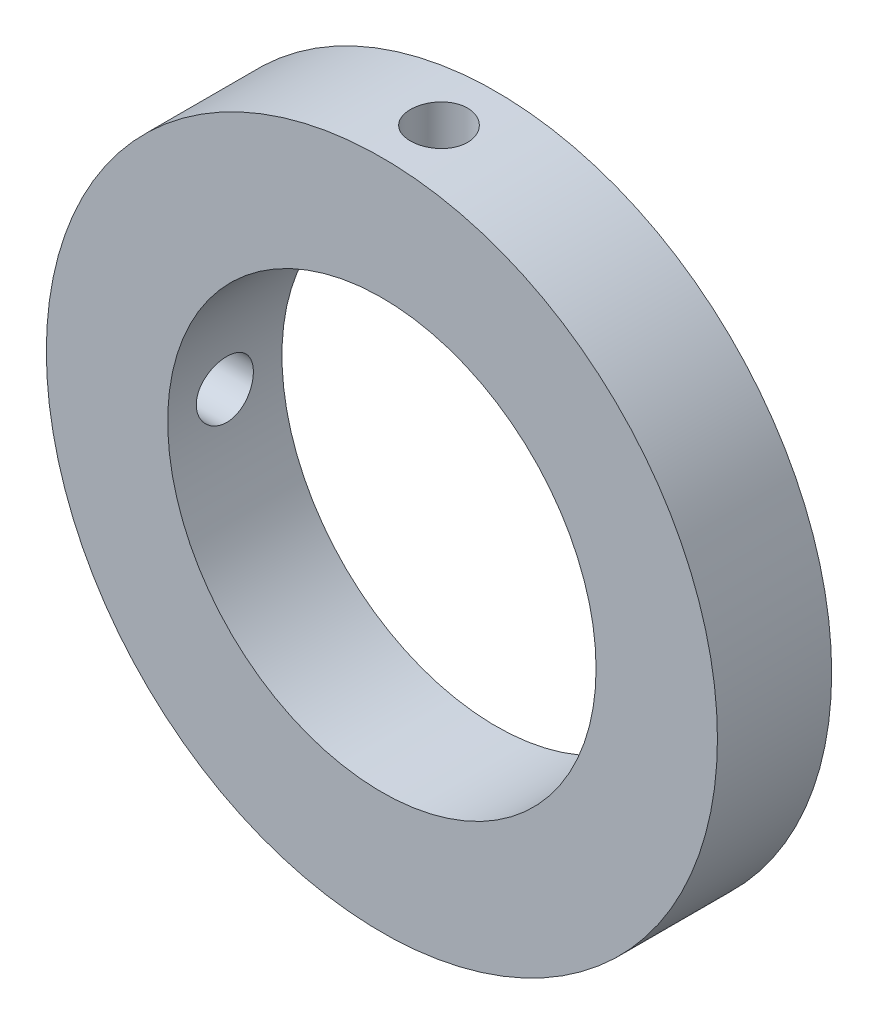
ISO-10303-21;
HEADER;
FILE_DESCRIPTION(('STEP AP214'),'2;1');
FILE_NAME('part.step','',(''),(''),'','','');
FILE_SCHEMA(('AUTOMOTIVE_DESIGN { 1 0 10303 214 1 1 1 1 }'));
ENDSEC;
DATA;
#1=APPLICATION_CONTEXT('core data for automotive mechanical design processes');
#2=APPLICATION_PROTOCOL_DEFINITION('international standard','automotive_design',2000,#1);
#3=PRODUCT_CONTEXT('',#1,'mechanical');
#4=PRODUCT('Part','Part','',(#3));
#5=PRODUCT_RELATED_PRODUCT_CATEGORY('part','',(#4));
#6=PRODUCT_DEFINITION_FORMATION('','',#4);
#7=PRODUCT_DEFINITION_CONTEXT('part definition',#1,'design');
#8=PRODUCT_DEFINITION('design','',#6,#7);
#9=PRODUCT_DEFINITION_SHAPE('','',#8);
#10=(LENGTH_UNIT() NAMED_UNIT(*) SI_UNIT(.MILLI.,.METRE.));
#11=(NAMED_UNIT(*) PLANE_ANGLE_UNIT() SI_UNIT($,.RADIAN.));
#12=(NAMED_UNIT(*) SI_UNIT($,.STERADIAN.) SOLID_ANGLE_UNIT());
#13=UNCERTAINTY_MEASURE_WITH_UNIT(LENGTH_MEASURE(1.E-05),#10,'distance_accuracy_value','');
#14=(GEOMETRIC_REPRESENTATION_CONTEXT(3) GLOBAL_UNCERTAINTY_ASSIGNED_CONTEXT((#13)) GLOBAL_UNIT_ASSIGNED_CONTEXT((#10,
#11,#12)) REPRESENTATION_CONTEXT('',''));
#15=CARTESIAN_POINT('',(0.,0.,0.));
#16=DIRECTION('',(0.,0.,1.));
#17=DIRECTION('',(1.,0.,0.));
#18=AXIS2_PLACEMENT_3D('',#15,#16,#17);
#19=CARTESIAN_POINT('',(0.,0.,8.));
#20=DIRECTION('',(0.,0.,1.));
#21=DIRECTION('',(1.,0.,0.));
#22=AXIS2_PLACEMENT_3D('',#19,#20,#21);
#23=PLANE('',#22);
#24=CARTESIAN_POINT('',(0.,0.,8.));
#25=DIRECTION('',(0.,0.,1.));
#26=DIRECTION('',(1.,0.,0.));
#27=AXIS2_PLACEMENT_3D('',#24,#25,#26);
#28=CIRCLE('',#27,23.5);
#29=CARTESIAN_POINT('',(23.5,0.,8.));
#30=VERTEX_POINT('',#29);
#31=EDGE_CURVE('E10',#30,#30,#28,.T.);
#32=ORIENTED_EDGE('',*,*,#31,.T.);
#33=EDGE_LOOP('',(#32));
#34=FACE_BOUND('',#33,.T.);
#35=CARTESIAN_POINT('',(0.,0.,8.));
#36=DIRECTION('',(0.,0.,1.));
#37=DIRECTION('',(1.,0.,0.));
#38=AXIS2_PLACEMENT_3D('',#35,#36,#37);
#39=CIRCLE('',#38,15.);
#40=CARTESIAN_POINT('',(15.,0.,8.));
#41=VERTEX_POINT('',#40);
#42=EDGE_CURVE('E51',#41,#41,#39,.T.);
#43=ORIENTED_EDGE('',*,*,#42,.F.);
#44=EDGE_LOOP('',(#43));
#45=FACE_BOUND('',#44,.T.);
#46=ADVANCED_FACE('F37',(#34,#45),#23,.T.);
#47=CARTESIAN_POINT('',(0.,0.,0.));
#48=DIRECTION('',(0.,0.,1.));
#49=DIRECTION('',(1.,0.,0.));
#50=AXIS2_PLACEMENT_3D('',#47,#48,#49);
#51=PLANE('',#50);
#52=CARTESIAN_POINT('',(0.,0.,0.));
#53=DIRECTION('',(0.,0.,1.));
#54=DIRECTION('',(1.,0.,0.));
#55=AXIS2_PLACEMENT_3D('',#52,#53,#54);
#56=CIRCLE('',#55,23.5);
#57=CARTESIAN_POINT('',(23.5,0.,0.));
#58=VERTEX_POINT('',#57);
#59=EDGE_CURVE('E42',#58,#58,#56,.T.);
#60=ORIENTED_EDGE('',*,*,#59,.F.);
#61=EDGE_LOOP('',(#60));
#62=FACE_BOUND('',#61,.T.);
#63=CARTESIAN_POINT('',(0.,0.,0.));
#64=DIRECTION('',(0.,0.,1.));
#65=DIRECTION('',(1.,0.,0.));
#66=AXIS2_PLACEMENT_3D('',#63,#64,#65);
#67=CIRCLE('',#66,15.);
#68=CARTESIAN_POINT('',(15.,0.,0.));
#69=VERTEX_POINT('',#68);
#70=EDGE_CURVE('E53',#69,#69,#67,.T.);
#71=ORIENTED_EDGE('',*,*,#70,.T.);
#72=EDGE_LOOP('',(#71));
#73=FACE_BOUND('',#72,.T.);
#74=ADVANCED_FACE('F88',(#62,#73),#51,.F.);
#75=CARTESIAN_POINT('',(0.,0.,8.));
#76=DIRECTION('',(0.,0.,-1.));
#77=DIRECTION('',(-1.,0.,0.));
#78=AXIS2_PLACEMENT_3D('',#75,#76,#77);
#79=CYLINDRICAL_SURFACE('',#78,23.5);
#80=CARTESIAN_POINT('',(-23.5,0.,6.));
#81=CARTESIAN_POINT('',(-23.4999988866651,-0.112123229769201,5.9999951065863));
#82=CARTESIAN_POINT('',(-23.4991890045528,-0.224322573517124,5.99053956778184));
#83=CARTESIAN_POINT('',(-23.4960360928998,-0.445616318942711,5.9529591232625));
#84=CARTESIAN_POINT('',(-23.4936913311316,-0.554707067003033,5.92481312343432));
#85=CARTESIAN_POINT('',(-23.4877336015421,-0.766546616788932,5.85067210537414));
#86=CARTESIAN_POINT('',(-23.4841213561534,-0.869298992076933,5.80468725325));
#87=CARTESIAN_POINT('',(-23.4760336376456,-1.06560228518032,5.69619221437259));
#88=CARTESIAN_POINT('',(-23.4715583479548,-1.1591551518568,5.63368553806174));
#89=CARTESIAN_POINT('',(-23.4622333709441,-1.33467623648226,5.49374233042156));
#90=CARTESIAN_POINT('',(-23.4573828278611,-1.41661669196157,5.41627103247056));
#91=CARTESIAN_POINT('',(-23.4478612006841,-1.56634871816151,5.24867124871695));
#92=CARTESIAN_POINT('',(-23.4431901245209,-1.63413966419486,5.15854220438072));
#93=CARTESIAN_POINT('',(-23.4345471555278,-1.75374279436174,4.96801662969354));
#94=CARTESIAN_POINT('',(-23.4305763378243,-1.80553049840485,4.86760467892561));
#95=CARTESIAN_POINT('',(-23.4237933648585,-1.89150071317162,4.65947102995426));
#96=CARTESIAN_POINT('',(-23.4209811883375,-1.92568354691007,4.55174946590893));
#97=CARTESIAN_POINT('',(-23.4168411560679,-1.97539297186546,4.33233314918643));
#98=CARTESIAN_POINT('',(-23.4155096948281,-1.99096488697627,4.22064873392267));
#99=CARTESIAN_POINT('',(-23.4144704730191,-2.00315047217665,3.99624409167833));
#100=CARTESIAN_POINT('',(-23.4147626807867,-1.99976451196352,3.8835238849395));
#101=CARTESIAN_POINT('',(-23.4169345031215,-1.97416791037035,3.6605581544508));
#102=CARTESIAN_POINT('',(-23.4188099620178,-1.95200654956399,3.55030692712201));
#103=CARTESIAN_POINT('',(-23.4239304529418,-1.88956480016654,3.33509468559295));
#104=CARTESIAN_POINT('',(-23.4271754988499,-1.84928422794199,3.23013372502014));
#105=CARTESIAN_POINT('',(-23.4346743098291,-1.75169237314649,3.02832456138188));
#106=CARTESIAN_POINT('',(-23.4389293815818,-1.69435900466839,2.93148708925001));
#107=CARTESIAN_POINT('',(-23.4479676066852,-1.56430495812446,2.74879112190973));
#108=CARTESIAN_POINT('',(-23.4527507711963,-1.49158395483874,2.66293285881005));
#109=CARTESIAN_POINT('',(-23.4623247268058,-1.33254263304903,2.50434598635165));
#110=CARTESIAN_POINT('',(-23.4671154936328,-1.24617971506071,2.43166009023105));
#111=CARTESIAN_POINT('',(-23.4761503430979,-1.06245464054071,2.3018115673023));
#112=CARTESIAN_POINT('',(-23.4803944253498,-0.96509247623753,2.24464895146223));
#113=CARTESIAN_POINT('',(-23.4878585742677,-0.762104721928345,2.14747219265524));
#114=CARTESIAN_POINT('',(-23.4910785263491,-0.656478208912319,2.10745996838497));
#115=CARTESIAN_POINT('',(-23.4961303162537,-0.439972968097537,2.04574983504057));
#116=CARTESIAN_POINT('',(-23.4979621841253,-0.329094354048099,2.02405152951734));
#117=CARTESIAN_POINT('',(-23.500027546738,-0.105602547297321,1.99963878359273));
#118=CARTESIAN_POINT('',(-23.5002660083826,0.00700415752780351,1.99686535074487));
#119=CARTESIAN_POINT('',(-23.4991309611319,0.231080915574299,2.01022649880017));
#120=CARTESIAN_POINT('',(-23.4977574679292,0.342550979850306,2.026360895634));
#121=CARTESIAN_POINT('',(-23.4935561570261,0.56102182056216,2.07703080729405));
#122=CARTESIAN_POINT('',(-23.4907305028014,0.668028990272134,2.11153895107965));
#123=CARTESIAN_POINT('',(-23.4839422526957,0.87473460698808,2.19794882390526));
#124=CARTESIAN_POINT('',(-23.4799796380928,0.97443293360727,2.24985083936804));
#125=CARTESIAN_POINT('',(-23.4713492002272,1.16395908728834,2.36972320517593));
#126=CARTESIAN_POINT('',(-23.4666796732491,1.25376213711802,2.43773260539869));
#127=CARTESIAN_POINT('',(-23.457165661042,1.42069837886321,2.5878328351477));
#128=CARTESIAN_POINT('',(-23.4523211726434,1.49783134111902,2.66992391986532));
#129=CARTESIAN_POINT('',(-23.4429885150815,1.63744048143301,2.84611338292093));
#130=CARTESIAN_POINT('',(-23.4385013022818,1.69987814155054,2.94024233982311));
#131=CARTESIAN_POINT('',(-23.4304049053355,1.80806012983393,3.13768349819379));
#132=CARTESIAN_POINT('',(-23.4267957121001,1.85380463080429,3.24099560458626));
#133=CARTESIAN_POINT('',(-23.4208694335715,1.92723628091616,3.45373444398497));
#134=CARTESIAN_POINT('',(-23.4185506662762,1.95494694423859,3.56315301176486));
#135=CARTESIAN_POINT('',(-23.4154621934875,1.99160084766112,3.78511044155885));
#136=CARTESIAN_POINT('',(-23.4146924568216,2.00054446542744,3.89764924073553));
#137=CARTESIAN_POINT('',(-23.4147896740478,1.99940595412868,4.1222697751252));
#138=CARTESIAN_POINT('',(-23.415651421826,1.98938434369543,4.23435182429875));
#139=CARTESIAN_POINT('',(-23.4189034453138,1.9507261135546,4.45523470737688));
#140=CARTESIAN_POINT('',(-23.4212937233022,1.922089466093,4.56403553638908));
#141=CARTESIAN_POINT('',(-23.4273321057134,1.84702952037953,4.77527102516025));
#142=CARTESIAN_POINT('',(-23.4309801280582,1.80060738275077,4.87770609982076));
#143=CARTESIAN_POINT('',(-23.4391230974554,1.69130092791677,5.07333883812549));
#144=CARTESIAN_POINT('',(-23.4436180320565,1.62841685272985,5.1665366375455));
#145=CARTESIAN_POINT('',(-23.4529654331836,1.48774412655109,5.34135906815437));
#146=CARTESIAN_POINT('',(-23.4578189478076,1.40991062623021,5.42294755481655));
#147=CARTESIAN_POINT('',(-23.4673270625175,1.24163079387903,5.57193609856443));
#148=CARTESIAN_POINT('',(-23.4719816142385,1.15118141763705,5.63933272127201));
#149=CARTESIAN_POINT('',(-23.4805761121491,0.960055887668371,5.75811883935542));
#150=CARTESIAN_POINT('',(-23.4845146659951,0.859360389579698,5.80947728281281));
#151=CARTESIAN_POINT('',(-23.4912172136603,0.650809957353694,5.89449161165884));
#152=CARTESIAN_POINT('',(-23.4939825543955,0.542963398493627,5.92816780789923));
#153=CARTESIAN_POINT('',(-23.497318663049,0.362069241592788,5.96830256055719));
#154=CARTESIAN_POINT('',(-23.4983195760804,0.290184348421729,5.98017325836303));
#155=CARTESIAN_POINT('',(-23.49966060501,0.145543660818374,5.9960235554232));
#156=CARTESIAN_POINT('',(-23.5000007227519,0.0727878688164575,6.00000317669367));
#157=CARTESIAN_POINT('',(-23.5,0.,6.));
#158=B_SPLINE_CURVE_WITH_KNOTS('',3,(#80,#81,#82,#83,#84,#85,#86,#87,#88,#89,#90,#91,#92,#93,
#94,#95,#96,#97,#98,#99,#100,#101,#102,#103,#104,#105,#106,#107,#108,#109,#110,#111,#112,#113,
#114,#115,#116,#117,#118,#119,#120,#121,#122,#123,#124,#125,#126,#127,#128,#129,#130,#131,#132,
#133,#134,#135,#136,#137,#138,#139,#140,#141,#142,#143,#144,#145,#146,#147,#148,#149,#150,#151,
#152,#153,#154,#155,#156,#157),.UNSPECIFIED.,.T.,.F.,(4,2,2,2,2,2,2,2,2,2,2,2,2,2,2,2,2,2,2,2,2,
2,2,2,2,2,2,2,2,2,2,2,2,2,2,2,2,2,4),(0.,0.336103930248838,0.672587834614635,1.00888026263078,
1.34510129492517,1.68211305898248,2.01913969864039,2.35667936318821,2.69421283432595,
3.03092261110221,3.36762582172775,3.70344800167612,4.03927358517125,4.37553602084552,
4.71180556418502,5.04914672410877,5.38648812238235,5.72386725081368,6.06123907566982,
6.39755876567944,6.7338751816154,7.06969198901707,7.40551432654503,7.74215930136561,
8.07881037758492,8.41633426224793,8.7538546528269,9.09093406673161,9.42800669721777,
9.76400553184259,10.1000048674247,10.4359822805189,10.7719547544546,11.1089513741573,
11.4460294523001,11.7837561664383,12.1210940947636,12.3392857851898,12.5574768668596),.UNSPECIFIED.);
#159=CARTESIAN_POINT('',(-23.5,0.,6.));
#160=VERTEX_POINT('',#159);
#161=EDGE_CURVE('E105',#160,#160,#158,.T.);
#162=ORIENTED_EDGE('',*,*,#161,.T.);
#163=EDGE_LOOP('',(#162));
#164=FACE_BOUND('',#163,.T.);
#165=CARTESIAN_POINT('',(0.,23.5,6.));
#166=CARTESIAN_POINT('',(-0.112123229769201,23.4999988866651,5.9999951065863));
#167=CARTESIAN_POINT('',(-0.224322573517124,23.4991890045528,5.99053956778183));
#168=CARTESIAN_POINT('',(-0.445616318942709,23.4960360928998,5.95295912326248));
#169=CARTESIAN_POINT('',(-0.55470706700303,23.4936913311316,5.9248131234343));
#170=CARTESIAN_POINT('',(-0.766546616788927,23.4877336015421,5.8506721053741));
#171=CARTESIAN_POINT('',(-0.869298992076925,23.4841213561534,5.80468725324997));
#172=CARTESIAN_POINT('',(-1.06560228518031,23.4760336376456,5.69619221437255));
#173=CARTESIAN_POINT('',(-1.15915515185679,23.4715583479548,5.63368553806169));
#174=CARTESIAN_POINT('',(-1.33467623648224,23.4622333709441,5.4937423304215));
#175=CARTESIAN_POINT('',(-1.41661669196155,23.4573828278611,5.4162710324705));
#176=CARTESIAN_POINT('',(-1.56634871816148,23.4478612006841,5.24867124871689));
#177=CARTESIAN_POINT('',(-1.63413966419483,23.4431901245209,5.15854220438065));
#178=CARTESIAN_POINT('',(-1.7537427943617,23.4345471555278,4.96801662969347));
#179=CARTESIAN_POINT('',(-1.8055304984048,23.4305763378243,4.86760467892553));
#180=CARTESIAN_POINT('',(-1.89150071317157,23.4237933648585,4.65947102995418));
#181=CARTESIAN_POINT('',(-1.92568354691001,23.4209811883375,4.55174946590885));
#182=CARTESIAN_POINT('',(-1.97539297186539,23.4168411560679,4.33233314918635));
#183=CARTESIAN_POINT('',(-1.9909648869762,23.4155096948281,4.22064873392259));
#184=CARTESIAN_POINT('',(-2.00315047217657,23.4144704730191,3.99624409167825));
#185=CARTESIAN_POINT('',(-1.99976451196344,23.4147626807867,3.88352388493942));
#186=CARTESIAN_POINT('',(-1.97416791037025,23.4169345031215,3.66055815445072));
#187=CARTESIAN_POINT('',(-1.95200654956388,23.4188099620178,3.55030692712193));
#188=CARTESIAN_POINT('',(-1.88956480016643,23.4239304529418,3.33509468559287));
#189=CARTESIAN_POINT('',(-1.84928422794187,23.4271754988499,3.23013372502007));
#190=CARTESIAN_POINT('',(-1.75169237314637,23.4346743098291,3.02832456138181));
#191=CARTESIAN_POINT('',(-1.69435900466827,23.4389293815818,2.93148708924994));
#192=CARTESIAN_POINT('',(-1.56430495812433,23.4479676066853,2.74879112190967));
#193=CARTESIAN_POINT('',(-1.4915839548386,23.4527507711963,2.66293285880999));
#194=CARTESIAN_POINT('',(-1.33254263304889,23.4623247268058,2.5043459863516));
#195=CARTESIAN_POINT('',(-1.24617971506056,23.4671154936328,2.43166009023099));
#196=CARTESIAN_POINT('',(-1.06245464054056,23.4761503430979,2.30181156730226));
#197=CARTESIAN_POINT('',(-0.965092476237375,23.4803944253498,2.24464895146219));
#198=CARTESIAN_POINT('',(-0.762104721928186,23.4878585742677,2.14747219265521));
#199=CARTESIAN_POINT('',(-0.656478208912159,23.4910785263491,2.10745996838494));
#200=CARTESIAN_POINT('',(-0.439972968097374,23.4961303162537,2.04574983504055));
#201=CARTESIAN_POINT('',(-0.329094354047935,23.4979621841253,2.02405152951733));
#202=CARTESIAN_POINT('',(-0.105602547297156,23.500027546738,1.99963878359273));
#203=CARTESIAN_POINT('',(0.00700415752796867,23.5002660083826,1.99686535074487));
#204=CARTESIAN_POINT('',(0.231080915574463,23.4991309611319,2.01022649880018));
#205=CARTESIAN_POINT('',(0.34255097985047,23.4977574679291,2.02636089563401));
#206=CARTESIAN_POINT('',(0.561021820562321,23.4935561570261,2.07703080729407));
#207=CARTESIAN_POINT('',(0.668028990272294,23.4907305028014,2.11153895107967));
#208=CARTESIAN_POINT('',(0.874734606988236,23.4839422526957,2.19794882390529));
#209=CARTESIAN_POINT('',(0.974432933607424,23.4799796380928,2.24985083936808));
#210=CARTESIAN_POINT('',(1.16395908728849,23.4713492002272,2.36972320517597));
#211=CARTESIAN_POINT('',(1.25376213711817,23.4666796732491,2.43773260539874));
#212=CARTESIAN_POINT('',(1.42069837886335,23.457165661042,2.58783283514776));
#213=CARTESIAN_POINT('',(1.49783134111915,23.4523211726434,2.66992391986539));
#214=CARTESIAN_POINT('',(1.63744048143314,23.4429885150815,2.84611338292099));
#215=CARTESIAN_POINT('',(1.69987814155066,23.4385013022818,2.94024233982318));
#216=CARTESIAN_POINT('',(1.80806012983404,23.4304049053355,3.13768349819387));
#217=CARTESIAN_POINT('',(1.8538046308044,23.4267957121001,3.24099560458634));
#218=CARTESIAN_POINT('',(1.92723628091627,23.4208694335715,3.45373444398504));
#219=CARTESIAN_POINT('',(1.95494694423869,23.4185506662762,3.56315301176494));
#220=CARTESIAN_POINT('',(1.99160084766121,23.4154621934875,3.78511044155893));
#221=CARTESIAN_POINT('',(2.00054446542752,23.4146924568216,3.89764924073561));
#222=CARTESIAN_POINT('',(1.99940595412876,23.4147896740478,4.12226977512528));
#223=CARTESIAN_POINT('',(1.9893843436955,23.415651421826,4.23435182429883));
#224=CARTESIAN_POINT('',(1.95072611355466,23.4189034453138,4.45523470737696));
#225=CARTESIAN_POINT('',(1.92208946609306,23.4212937233022,4.56403553638916));
#226=CARTESIAN_POINT('',(1.84702952037958,23.4273321057134,4.77527102516033));
#227=CARTESIAN_POINT('',(1.80060738275082,23.4309801280582,4.87770609982083));
#228=CARTESIAN_POINT('',(1.69130092791681,23.4391230974554,5.07333883812556));
#229=CARTESIAN_POINT('',(1.62841685272988,23.4436180320565,5.16653663754557));
#230=CARTESIAN_POINT('',(1.48774412655112,23.4529654331836,5.34135906815443));
#231=CARTESIAN_POINT('',(1.40991062623023,23.4578189478076,5.42294755481661));
#232=CARTESIAN_POINT('',(1.24163079387905,23.4673270625175,5.57193609856448));
#233=CARTESIAN_POINT('',(1.15118141763707,23.4719816142385,5.63933272127205));
#234=CARTESIAN_POINT('',(0.96005588766838,23.4805761121491,5.75811883935546));
#235=CARTESIAN_POINT('',(0.859360389579704,23.4845146659951,5.80947728281285));
#236=CARTESIAN_POINT('',(0.650809957353696,23.4912172136603,5.89449161165887));
#237=CARTESIAN_POINT('',(0.542963398493629,23.4939825543955,5.92816780789926));
#238=CARTESIAN_POINT('',(0.362069241592788,23.497318663049,5.96830256055721));
#239=CARTESIAN_POINT('',(0.29018434842173,23.4983195760804,5.98017325836304));
#240=CARTESIAN_POINT('',(0.145543660818374,23.49966060501,5.99602355542321));
#241=CARTESIAN_POINT('',(0.0727878688164576,23.5000007227519,6.00000317669367));
#242=CARTESIAN_POINT('',(0.,23.5,6.));
#243=B_SPLINE_CURVE_WITH_KNOTS('',3,(#165,#166,#167,#168,#169,#170,#171,#172,#173,#174,#175,
#176,#177,#178,#179,#180,#181,#182,#183,#184,#185,#186,#187,#188,#189,#190,#191,#192,#193,#194,
#195,#196,#197,#198,#199,#200,#201,#202,#203,#204,#205,#206,#207,#208,#209,#210,#211,#212,#213,
#214,#215,#216,#217,#218,#219,#220,#221,#222,#223,#224,#225,#226,#227,#228,#229,#230,#231,#232,
#233,#234,#235,#236,#237,#238,#239,#240,#241,#242),.UNSPECIFIED.,.T.,.F.,(4,2,2,2,2,2,2,2,2,2,2,
2,2,2,2,2,2,2,2,2,2,2,2,2,2,2,2,2,2,2,2,2,2,2,2,2,2,2,4),(0.,0.336103930248838,
0.672587834614635,1.00888026263078,1.34510129492518,1.68211305898248,2.01913969864039,
2.35667936318821,2.69421283432595,3.03092261110221,3.36762582172775,3.70344800167612,
4.03927358517125,4.37553602084552,4.71180556418502,5.04914672410877,5.38648812238235,
5.72386725081368,6.06123907566982,6.39755876567944,6.7338751816154,7.06969198901707,
7.40551432654503,7.74215930136561,8.07881037758492,8.41633426224793,8.7538546528269,
9.09093406673161,9.42800669721777,9.76400553184259,10.1000048674247,10.4359822805189,
10.7719547544546,11.1089513741573,11.4460294523001,11.7837561664383,12.1210940947636,
12.3392857851898,12.5574768668596),.UNSPECIFIED.);
#244=CARTESIAN_POINT('',(0.,23.5,6.));
#245=VERTEX_POINT('',#244);
#246=EDGE_CURVE('E57',#245,#245,#243,.T.);
#247=ORIENTED_EDGE('',*,*,#246,.T.);
#248=EDGE_LOOP('',(#247));
#249=FACE_BOUND('',#248,.T.);
#250=ORIENTED_EDGE('',*,*,#31,.F.);
#251=EDGE_LOOP('',(#250));
#252=FACE_BOUND('',#251,.T.);
#253=ORIENTED_EDGE('',*,*,#59,.T.);
#254=EDGE_LOOP('',(#253));
#255=FACE_BOUND('',#254,.T.);
#256=ADVANCED_FACE('F39',(#164,#249,#252,#255),#79,.T.);
#257=CARTESIAN_POINT('',(0.,0.,8.));
#258=DIRECTION('',(0.,0.,-1.));
#259=DIRECTION('',(-1.,0.,0.));
#260=AXIS2_PLACEMENT_3D('',#257,#258,#259);
#261=CYLINDRICAL_SURFACE('',#260,15.);
#262=CARTESIAN_POINT('',(-14.8660687473185,-2.00000000000005,4.));
#263=CARTESIAN_POINT('',(-14.8660704451043,-1.99999528594764,4.11180385546753));
#264=CARTESIAN_POINT('',(-14.8673436464034,-1.99059326704133,4.22367603311622));
#265=CARTESIAN_POINT('',(-14.8722964859732,-1.95323796266135,4.44430246233589));
#266=CARTESIAN_POINT('',(-14.8759785863295,-1.92526569649118,4.5530534049172));
#267=CARTESIAN_POINT('',(-14.8853249214529,-1.85161311140269,4.76421136822632));
#268=CARTESIAN_POINT('',(-14.8909877556206,-1.8059453027505,4.86662281161769));
#269=CARTESIAN_POINT('',(-14.9036558225185,-1.69822564880692,5.06231107570956));
#270=CARTESIAN_POINT('',(-14.9106608397868,-1.63617643263474,5.15558935893803));
#271=CARTESIAN_POINT('',(-14.9252737732073,-1.49703370489523,5.33097345466847));
#272=CARTESIAN_POINT('',(-14.9328848849373,-1.41985682274865,5.41301286567938));
#273=CARTESIAN_POINT('',(-14.9478237625824,-1.25282922872615,5.56301624545638));
#274=CARTESIAN_POINT('',(-14.9551515139324,-1.16297786647203,5.63097949147619));
#275=CARTESIAN_POINT('',(-14.9687309976037,-0.972731724927664,5.7511418417164));
#276=CARTESIAN_POINT('',(-14.9749785650228,-0.872298437711274,5.80328048929025));
#277=CARTESIAN_POINT('',(-14.9856585341581,-0.664003816037419,5.8899261641808));
#278=CARTESIAN_POINT('',(-14.990091012146,-0.556142793922452,5.92443393237768));
#279=CARTESIAN_POINT('',(-14.9966188619561,-0.336735375014141,5.97463890958027));
#280=CARTESIAN_POINT('',(-14.9987279820508,-0.22521472346995,5.99044681501196));
#281=CARTESIAN_POINT('',(-15.0004184797152,-0.00108500230370847,6.00314660873682));
#282=CARTESIAN_POINT('',(-14.9999999696283,0.111524018722414,6.00003933773652));
#283=CARTESIAN_POINT('',(-14.9966934411691,0.333880124465717,5.97508526945905));
#284=CARTESIAN_POINT('',(-14.9938211133781,0.443640837361733,5.95335753525435));
#285=CARTESIAN_POINT('',(-14.9859472409229,0.657944122712502,5.89196567297849));
#286=CARTESIAN_POINT('',(-14.9809456511403,0.762486584541787,5.85230116483189));
#287=CARTESIAN_POINT('',(-14.9693481900416,0.963751808424076,5.75603655887818));
#288=CARTESIAN_POINT('',(-14.9627475214588,1.06044984935321,5.69938537681692));
#289=CARTESIAN_POINT('',(-14.9486895041904,1.24301169073473,5.57079274271714));
#290=CARTESIAN_POINT('',(-14.9412321108429,1.32887492586676,5.4988504933722));
#291=CARTESIAN_POINT('',(-14.9262258809566,1.48803006154534,5.34105215164107));
#292=CARTESIAN_POINT('',(-14.918676784244,1.56121903353016,5.25509223180637));
#293=CARTESIAN_POINT('',(-14.9043949876924,1.69214693057186,5.07205406862743));
#294=CARTESIAN_POINT('',(-14.8976622910908,1.74988579436348,4.97497578119703));
#295=CARTESIAN_POINT('',(-14.8857757633434,1.84828286086495,4.7723599996533));
#296=CARTESIAN_POINT('',(-14.8806227621479,1.88893208906701,4.66681809548151));
#297=CARTESIAN_POINT('',(-14.8724947546572,1.95190090044919,4.45032197936162));
#298=CARTESIAN_POINT('',(-14.8695196283616,1.97422149354138,4.33936806597344));
#299=CARTESIAN_POINT('',(-14.8661064501035,1.99976160768722,4.11610866499504));
#300=CARTESIAN_POINT('',(-14.8656491151163,2.00312631098807,4.00382006966746));
#301=CARTESIAN_POINT('',(-14.867272242967,1.99104288188791,3.78028074389526));
#302=CARTESIAN_POINT('',(-14.8693526440475,1.97559520729771,3.66902998826055));
#303=CARTESIAN_POINT('',(-14.8757992043677,1.92644805037014,3.45116401359439));
#304=CARTESIAN_POINT('',(-14.8801564778765,1.89281950323355,3.3445325069819));
#305=CARTESIAN_POINT('',(-14.8906585901441,1.8083384508012,3.13842108654756));
#306=CARTESIAN_POINT('',(-14.8968034998284,1.75748526209378,3.03894145667628));
#307=CARTESIAN_POINT('',(-14.9102344661952,1.63964406417206,2.84930268955919));
#308=CARTESIAN_POINT('',(-14.9175271378913,1.57256123166295,2.75920295163176));
#309=CARTESIAN_POINT('',(-14.9324114351651,1.42429832312794,2.59148906156291));
#310=CARTESIAN_POINT('',(-14.9400030739993,1.34311762143749,2.51387546385198));
#311=CARTESIAN_POINT('',(-14.9546894865533,1.16832754835818,2.37282344607888));
#312=CARTESIAN_POINT('',(-14.9617807004972,1.07464064093247,2.30948068362839));
#313=CARTESIAN_POINT('',(-14.974613414783,0.877872452317567,2.19943171782467));
#314=CARTESIAN_POINT('',(-14.9803549454849,0.774791382513647,2.15272514024389));
#315=CARTESIAN_POINT('',(-14.9898256469115,0.56247277252338,2.07743073841187));
#316=CARTESIAN_POINT('',(-14.9935608482078,0.453254784247309,2.04878857091645));
#317=CARTESIAN_POINT('',(-14.9986231668662,0.231506493423145,2.01025951453902));
#318=CARTESIAN_POINT('',(-14.9999504085613,0.11897636219977,2.00037165729229));
#319=CARTESIAN_POINT('',(-15.0000464724842,-0.105269873711641,1.99965173275968));
#320=CARTESIAN_POINT('',(-14.9988350491343,-0.216985525921932,2.00867252940561));
#321=CARTESIAN_POINT('',(-14.9940293321986,-0.437297443052405,2.04520104123198));
#322=CARTESIAN_POINT('',(-14.9904350419501,-0.545893712341099,2.0727087305213));
#323=CARTESIAN_POINT('',(-14.9812655664247,-0.756858234588912,2.14538204707667));
#324=CARTESIAN_POINT('',(-14.9756912840831,-0.859229301543963,2.19053962640806));
#325=CARTESIAN_POINT('',(-14.9631774939599,-1.05496407863093,2.29721554964574));
#326=CARTESIAN_POINT('',(-14.95623796097,-1.14832762239922,2.35873419565244));
#327=CARTESIAN_POINT('',(-14.9417029120984,-1.32414728606679,2.49692668200364));
#328=CARTESIAN_POINT('',(-14.9341029029987,-1.40651715716405,2.57370979013919));
#329=CARTESIAN_POINT('',(-14.919138648968,-1.55725895587221,2.74002306904736));
#330=CARTESIAN_POINT('',(-14.911774460102,-1.62562757530237,2.82955624392126));
#331=CARTESIAN_POINT('',(-14.8980810988492,-1.746687909785,3.01928394157089));
#332=CARTESIAN_POINT('',(-14.8917566176026,-1.79930940429131,3.1195235915101));
#333=CARTESIAN_POINT('',(-14.8809136658427,-1.88689518281496,3.32744846751705));
#334=CARTESIAN_POINT('',(-14.8763932602426,-1.92187839666371,3.43512556975937));
#335=CARTESIAN_POINT('',(-14.8707513382361,-1.96495480378588,3.61944827872554));
#336=CARTESIAN_POINT('',(-14.8690042861798,-1.97807748135808,3.69493827296814));
#337=CARTESIAN_POINT('',(-14.866662414787,-1.99560165343187,3.8469415094705));
#338=CARTESIAN_POINT('',(-14.8660675849485,-2.00000322742325,3.92345474239741));
#339=CARTESIAN_POINT('',(-14.8660687473185,-2.00000000000005,4.));
#340=B_SPLINE_CURVE_WITH_KNOTS('',3,(#262,#263,#264,#265,#266,#267,#268,#269,#270,#271,#272,
#273,#274,#275,#276,#277,#278,#279,#280,#281,#282,#283,#284,#285,#286,#287,#288,#289,#290,#291,
#292,#293,#294,#295,#296,#297,#298,#299,#300,#301,#302,#303,#304,#305,#306,#307,#308,#309,#310,
#311,#312,#313,#314,#315,#316,#317,#318,#319,#320,#321,#322,#323,#324,#325,#326,#327,#328,#329,
#330,#331,#332,#333,#334,#335,#336,#337,#338,#339),.UNSPECIFIED.,.T.,.F.,(4,2,2,2,2,2,2,2,2,2,2,
2,2,2,2,2,2,2,2,2,2,2,2,2,2,2,2,2,2,2,2,2,2,2,2,2,2,2,4),(0.,0.335131889250449,
0.670606846105683,1.00584506276825,1.34102950834956,1.67811595121165,2.01521969762238,
2.35359556525146,2.69195721256928,3.02830569524969,3.36463922864856,3.69883808669953,
4.03304402666679,4.36826528456251,4.70350402584628,5.04134915068959,5.37919561519091,
5.71721927655741,6.05522431149102,6.3906370258193,6.72604157783542,7.06014684818595,
7.3942653761821,7.73038528142333,8.06652010750621,8.40484511764504,8.74316251675152,
9.08045723770335,9.41773454222147,9.752397098563,10.0870591862064,10.4215688535019,
10.7560846978108,11.0930874236894,11.430169684094,11.768733419821,12.1069330231324,
12.3363794094425,12.5658237044201),.UNSPECIFIED.);
#341=CARTESIAN_POINT('',(-14.8660687473185,-2.00000000000005,4.));
#342=VERTEX_POINT('',#341);
#343=EDGE_CURVE('E111',#342,#342,#340,.T.);
#344=ORIENTED_EDGE('',*,*,#343,.T.);
#345=EDGE_LOOP('',(#344));
#346=FACE_BOUND('',#345,.T.);
#347=CARTESIAN_POINT('',(0.,15.,6.));
#348=CARTESIAN_POINT('',(0.111808835669284,14.9999983574254,5.99999529029309));
#349=CARTESIAN_POINT('',(0.22368597927628,14.9987367072719,5.99059246203753));
#350=CARTESIAN_POINT('',(0.444322725138079,14.993825111269,5.95323365095044));
#351=CARTESIAN_POINT('',(0.553079022333037,14.9901727244172,5.92525870510285));
#352=CARTESIAN_POINT('',(0.764248312626984,14.9808907984907,5.85159828245855));
#353=CARTESIAN_POINT('',(0.866665683058494,14.9752626421097,5.80592518896156));
#354=CARTESIAN_POINT('',(1.0623638950303,14.9626538666039,5.69819308619372));
#355=CARTESIAN_POINT('',(1.15564620633702,14.9556734655857,5.63613671883354));
#356=CARTESIAN_POINT('',(1.33102582250468,14.9410899478996,5.49698673839582));
#357=CARTESIAN_POINT('',(1.41305798549586,14.9334835816211,5.41981135499153));
#358=CARTESIAN_POINT('',(1.56304735673102,14.9185313755795,5.25278981092335));
#359=CARTESIAN_POINT('',(1.63100381997221,14.9111855496234,5.16294298000419));
#360=CARTESIAN_POINT('',(1.75115902268907,14.8975543544019,4.97270087705497));
#361=CARTESIAN_POINT('',(1.80329607482578,14.8912731776576,4.87226631752138));
#362=CARTESIAN_POINT('',(1.8899384500729,14.8805258737923,4.66396893276321));
#363=CARTESIAN_POINT('',(1.92444453245278,14.8760596685121,4.55610642764669));
#364=CARTESIAN_POINT('',(1.97464606772174,14.8694793656867,4.33669418949834));
#365=CARTESIAN_POINT('',(1.99045204228506,14.8673514537014,4.22517016546708));
#366=CARTESIAN_POINT('',(2.00314680548117,14.8656465160931,4.00103382039405));
#367=CARTESIAN_POINT('',(2.00003645633601,14.866069374204,3.8884215491891));
#368=CARTESIAN_POINT('',(1.97507745939234,14.8694055577299,3.66607886997207));
#369=CARTESIAN_POINT('',(1.95335097531762,14.8723026462234,3.5563344701143));
#370=CARTESIAN_POINT('',(1.89196724634371,14.8802355277475,3.34206316323991));
#371=CARTESIAN_POINT('',(1.85230959261457,14.8852713695413,3.23753637524499));
#372=CARTESIAN_POINT('',(1.75605929143191,14.8969326111103,3.0362903652928));
#373=CARTESIAN_POINT('',(1.69941397913749,14.903562941239,2.93959662880569));
#374=CARTESIAN_POINT('',(1.57083393344289,14.9176623621993,2.75704091808234));
#375=CARTESIAN_POINT('',(1.49889840502385,14.9251314966353,2.67117950744583));
#376=CARTESIAN_POINT('',(1.34110490026362,14.9401389923359,2.5120169874181));
#377=CARTESIAN_POINT('',(1.25514170702645,14.947677435412,2.43882015729767));
#378=CARTESIAN_POINT('',(1.07209417013341,14.9619192381826,2.30787795507161));
#379=CARTESIAN_POINT('',(0.97500979444237,14.9686225954715,2.25013262747648));
#380=CARTESIAN_POINT('',(0.77239221973047,14.9804439374358,2.15173088230526));
#381=CARTESIAN_POINT('',(0.666855578841231,14.9855612720896,2.11108146895369));
#382=CARTESIAN_POINT('',(0.45037092433625,14.9936282590407,2.04811068102765));
#383=CARTESIAN_POINT('',(0.339423199542258,14.9965780268993,2.02578832936061));
#384=CARTESIAN_POINT('',(0.116166903325644,14.9999624137686,2.00024156722888));
#385=CARTESIAN_POINT('',(0.0038750345470432,15.0004159384905,1.99687359821651));
#386=CARTESIAN_POINT('',(-0.219671617218717,14.9988079153852,2.00895166412718));
#387=CARTESIAN_POINT('',(-0.330926425345664,14.996746428686,2.02439724178236));
#388=CARTESIAN_POINT('',(-0.548813715572937,14.990351753581,2.07354465338398));
#389=CARTESIAN_POINT('',(-0.655462016512044,14.9860271430292,2.10717756832215));
#390=CARTESIAN_POINT('',(-0.861605098793558,14.9755900925429,2.19167296593709));
#391=CARTESIAN_POINT('',(-0.961099607015637,14.9694775843944,2.24253610601325));
#392=CARTESIAN_POINT('',(-1.15074887861608,14.9560983737007,2.36039215558331));
#393=CARTESIAN_POINT('',(-1.2408458143966,14.9488251504572,2.42747736571333));
#394=CARTESIAN_POINT('',(-1.4085529469919,14.9339572870998,2.57574332922425));
#395=CARTESIAN_POINT('',(-1.48616257662378,14.9263626324062,2.65692472251643));
#396=CARTESIAN_POINT('',(-1.62720549423098,14.9116490247351,2.83171314263955));
#397=CARTESIAN_POINT('',(-1.69054327608938,14.904533487753,2.92539756673816));
#398=CARTESIAN_POINT('',(-1.80058351078814,14.8916413300182,3.12215941028092));
#399=CARTESIAN_POINT('',(-1.84728633510346,14.8858646793678,3.22523661991038));
#400=CARTESIAN_POINT('',(-1.92257836500746,14.8763281178008,3.43755724202769));
#401=CARTESIAN_POINT('',(-1.95122028846795,14.872562342326,3.5467816852108));
#402=CARTESIAN_POINT('',(-1.98974667143959,14.8674574869829,3.76854363212876));
#403=CARTESIAN_POINT('',(-1.99963213426782,14.8661182773134,3.88108095832443));
#404=CARTESIAN_POINT('',(-2.00034485806189,14.8660223129545,4.10532349085351));
#405=CARTESIAN_POINT('',(-1.99132219194493,14.8672452228252,4.21702824096424));
#406=CARTESIAN_POINT('',(-1.95479376686689,14.872091838742,4.43731787510387));
#407=CARTESIAN_POINT('',(-1.92728801483269,14.8757155438883,4.54590276030197));
#408=CARTESIAN_POINT('',(-1.85462310332207,14.8849489027276,4.75684368325159));
#409=CARTESIAN_POINT('',(-1.80947220819041,14.890557626594,4.85920261111686));
#410=CARTESIAN_POINT('',(-1.70281342759737,14.9031304571282,5.05491588382606));
#411=CARTESIAN_POINT('',(-1.64130522630429,14.910094589966,5.14827005475604));
#412=CARTESIAN_POINT('',(-1.50312448509508,14.9246596718306,5.32408964992841));
#413=CARTESIAN_POINT('',(-1.42634027226901,14.9322650575408,5.40646694775513));
#414=CARTESIAN_POINT('',(-1.26002169349824,14.9472171900166,5.55722321636154));
#415=CARTESIAN_POINT('',(-1.17048434072978,14.9545638756898,5.62559889875025));
#416=CARTESIAN_POINT('',(-0.980752987852823,14.9682063513753,5.74666713846652));
#417=CARTESIAN_POINT('',(-0.880514620743967,14.9744974642689,5.79929066655524));
#418=CARTESIAN_POINT('',(-0.67259240958733,14.9852732065897,5.88688059854508));
#419=CARTESIAN_POINT('',(-0.564916678969891,14.9897597692431,5.92186590862486));
#420=CARTESIAN_POINT('',(-0.38058840809842,14.9953572174327,5.96494800638518));
#421=CARTESIAN_POINT('',(-0.305091081955779,14.9970896363507,5.97807324352364));
#422=CARTESIAN_POINT('',(-0.153073171616112,14.9994115849077,5.99560081416547));
#423=CARTESIAN_POINT('',(-0.0765525964512404,15.000001124628,6.0000032246136));
#424=CARTESIAN_POINT('',(0.,15.,6.));
#425=B_SPLINE_CURVE_WITH_KNOTS('',3,(#347,#348,#349,#350,#351,#352,#353,#354,#355,#356,#357,
#358,#359,#360,#361,#362,#363,#364,#365,#366,#367,#368,#369,#370,#371,#372,#373,#374,#375,#376,
#377,#378,#379,#380,#381,#382,#383,#384,#385,#386,#387,#388,#389,#390,#391,#392,#393,#394,#395,
#396,#397,#398,#399,#400,#401,#402,#403,#404,#405,#406,#407,#408,#409,#410,#411,#412,#413,#414,
#415,#416,#417,#418,#419,#420,#421,#422,#423,#424),.UNSPECIFIED.,.T.,.F.,(4,2,2,2,2,2,2,2,2,2,2,
2,2,2,2,2,2,2,2,2,2,2,2,2,2,2,2,2,2,2,2,2,2,2,2,2,2,2,4),(0.,0.335146851305743,
0.670636430885044,1.0058916928274,1.34109292564035,1.67815978443559,2.01524447904836,
2.35362721511647,2.69199537766205,3.02835355914359,3.3646964092492,3.69884885098043,
4.0330089117585,4.36821583137897,4.70344018443797,5.04130544484849,5.37917167852296,
5.71717620202538,6.05516270391743,6.39058584992061,6.72600084354478,7.06015363396463,
7.39431917503546,7.73043274769884,8.06656158258761,8.4048770453545,8.74318495273048,
9.08050074735454,9.41779849783634,9.75242927496624,10.0870599266874,10.4215340370262,
10.756014605959,11.0930366783511,11.4301378125116,11.7686952667452,12.1068890499242,
12.3363573904731,12.5658237068544),.UNSPECIFIED.);
#426=CARTESIAN_POINT('',(0.,15.,6.));
#427=VERTEX_POINT('',#426);
#428=EDGE_CURVE('E68',#427,#427,#425,.T.);
#429=ORIENTED_EDGE('',*,*,#428,.T.);
#430=EDGE_LOOP('',(#429));
#431=FACE_BOUND('',#430,.T.);
#432=ORIENTED_EDGE('',*,*,#42,.T.);
#433=EDGE_LOOP('',(#432));
#434=FACE_BOUND('',#433,.T.);
#435=ORIENTED_EDGE('',*,*,#70,.F.);
#436=EDGE_LOOP('',(#435));
#437=FACE_BOUND('',#436,.T.);
#438=ADVANCED_FACE('F79',(#346,#431,#434,#437),#261,.F.);
#439=CARTESIAN_POINT('',(0.,-23.501,4.));
#440=DIRECTION('',(0.,1.,0.));
#441=DIRECTION('',(0.,0.,1.));
#442=AXIS2_PLACEMENT_3D('',#439,#440,#441);
#443=CYLINDRICAL_SURFACE('',#442,2.);
#444=ORIENTED_EDGE('',*,*,#428,.F.);
#445=EDGE_LOOP('',(#444));
#446=FACE_BOUND('',#445,.T.);
#447=ORIENTED_EDGE('',*,*,#246,.F.);
#448=EDGE_LOOP('',(#447));
#449=FACE_BOUND('',#448,.T.);
#450=ADVANCED_FACE('F74',(#446,#449),#443,.F.);
#451=CARTESIAN_POINT('',(23.5010000000001,0.,4.));
#452=DIRECTION('',(-1.,0.,0.));
#453=DIRECTION('',(0.,-1.,0.));
#454=AXIS2_PLACEMENT_3D('',#451,#452,#453);
#455=CYLINDRICAL_SURFACE('',#454,2.);
#456=ORIENTED_EDGE('',*,*,#343,.F.);
#457=EDGE_LOOP('',(#456));
#458=FACE_BOUND('',#457,.T.);
#459=ORIENTED_EDGE('',*,*,#161,.F.);
#460=EDGE_LOOP('',(#459));
#461=FACE_BOUND('',#460,.T.);
#462=ADVANCED_FACE('F78',(#458,#461),#455,.F.);
#463=CLOSED_SHELL('',(#46,#74,#256,#438,#450,#462));
#464=MANIFOLD_SOLID_BREP('B2',#463);
#465=ADVANCED_BREP_SHAPE_REPRESENTATION('',(#18,#464),#14);
#466=SHAPE_DEFINITION_REPRESENTATION(#9,#465);
ENDSEC;
END-ISO-10303-21;
